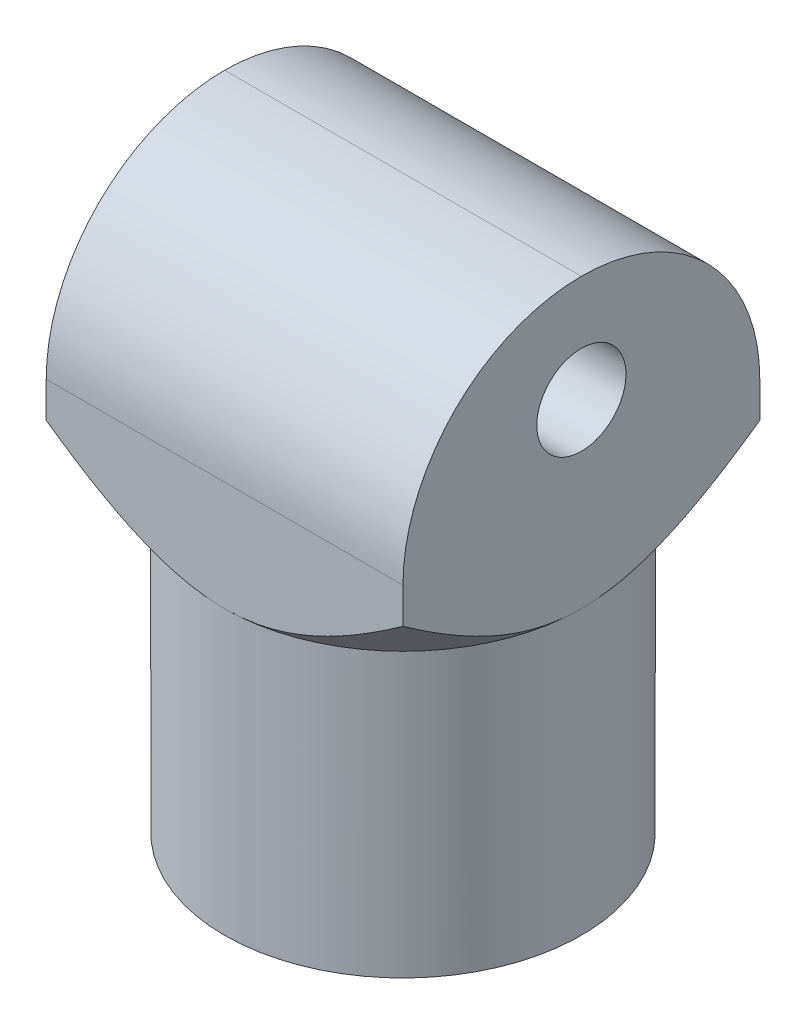
ISO-10303-21;
HEADER;
FILE_DESCRIPTION(('STEP AP214'),'2;1');
FILE_NAME('part.step','',(''),(''),'','','');
FILE_SCHEMA(('AUTOMOTIVE_DESIGN { 1 0 10303 214 1 1 1 1 }'));
ENDSEC;
DATA;
#1=APPLICATION_CONTEXT('core data for automotive mechanical design processes');
#2=APPLICATION_PROTOCOL_DEFINITION('international standard','automotive_design',2000,#1);
#3=PRODUCT_CONTEXT('',#1,'mechanical');
#4=PRODUCT('Part','Part','',(#3));
#5=PRODUCT_RELATED_PRODUCT_CATEGORY('part','',(#4));
#6=PRODUCT_DEFINITION_FORMATION('','',#4);
#7=PRODUCT_DEFINITION_CONTEXT('part definition',#1,'design');
#8=PRODUCT_DEFINITION('design','',#6,#7);
#9=PRODUCT_DEFINITION_SHAPE('','',#8);
#10=(LENGTH_UNIT() NAMED_UNIT(*) SI_UNIT(.MILLI.,.METRE.));
#11=(NAMED_UNIT(*) PLANE_ANGLE_UNIT() SI_UNIT($,.RADIAN.));
#12=(NAMED_UNIT(*) SI_UNIT($,.STERADIAN.) SOLID_ANGLE_UNIT());
#13=UNCERTAINTY_MEASURE_WITH_UNIT(LENGTH_MEASURE(1.E-05),#10,'distance_accuracy_value','');
#14=(GEOMETRIC_REPRESENTATION_CONTEXT(3) GLOBAL_UNCERTAINTY_ASSIGNED_CONTEXT((#13)) GLOBAL_UNIT_ASSIGNED_CONTEXT((#10,
#11,#12)) REPRESENTATION_CONTEXT('',''));
#15=CARTESIAN_POINT('',(0.,0.,0.));
#16=DIRECTION('',(0.,0.,1.));
#17=DIRECTION('',(1.,0.,0.));
#18=AXIS2_PLACEMENT_3D('',#15,#16,#17);
#19=CARTESIAN_POINT('',(0.,0.,0.));
#20=DIRECTION('',(0.,-1.,0.));
#21=DIRECTION('',(0.,0.,-1.));
#22=AXIS2_PLACEMENT_3D('',#19,#20,#21);
#23=PLANE('',#22);
#24=DIRECTION('',(0.,0.,-1.));
#25=VECTOR('',#24,1.);
#26=CARTESIAN_POINT('',(10.,0.,0.));
#27=LINE('',#26,#25);
#28=CARTESIAN_POINT('',(10.,0.,-9.9984897719211));
#29=VERTEX_POINT('',#28);
#30=CARTESIAN_POINT('',(10.,0.,-10.));
#31=VERTEX_POINT('',#30);
#32=EDGE_CURVE('E263',#29,#31,#27,.T.);
#33=ORIENTED_EDGE('',*,*,#32,.F.);
#34=CARTESIAN_POINT('',(5.,0.,-5.));
#35=DIRECTION('',(0.,-1.,0.));
#36=DIRECTION('',(0.,0.,-1.));
#37=AXIS2_PLACEMENT_3D('',#34,#35,#36);
#38=CIRCLE('',#37,7.06999999999999);
#39=CARTESIAN_POINT('',(9.9984897719211,0.,-10.));
#40=VERTEX_POINT('',#39);
#41=EDGE_CURVE('E331',#29,#40,#38,.F.);
#42=ORIENTED_EDGE('',*,*,#41,.T.);
#43=DIRECTION('',(-1.,0.,0.));
#44=VECTOR('',#43,1.);
#45=CARTESIAN_POINT('',(0.,0.,-10.));
#46=LINE('',#45,#44);
#47=EDGE_CURVE('E269',#31,#40,#46,.T.);
#48=ORIENTED_EDGE('',*,*,#47,.F.);
#49=EDGE_LOOP('',(#33,#42,#48));
#50=FACE_BOUND('',#49,.T.);
#51=ADVANCED_FACE('F39',(#50),#23,.T.);
#52=DIRECTION('',(1.,0.,0.));
#53=VECTOR('',#52,1.);
#54=CARTESIAN_POINT('',(0.,0.,0.));
#55=LINE('',#54,#53);
#56=CARTESIAN_POINT('',(9.9984897719211,0.,0.));
#57=VERTEX_POINT('',#56);
#58=CARTESIAN_POINT('',(10.,0.,0.));
#59=VERTEX_POINT('',#58);
#60=EDGE_CURVE('E258',#57,#59,#55,.T.);
#61=ORIENTED_EDGE('',*,*,#60,.F.);
#62=CARTESIAN_POINT('',(5.,0.,-5.));
#63=DIRECTION('',(0.,-1.,0.));
#64=DIRECTION('',(0.,0.,-1.));
#65=AXIS2_PLACEMENT_3D('',#62,#63,#64);
#66=CIRCLE('',#65,7.06999999999999);
#67=CARTESIAN_POINT('',(10.,0.,-0.00151022807889948));
#68=VERTEX_POINT('',#67);
#69=EDGE_CURVE('E324',#57,#68,#66,.F.);
#70=ORIENTED_EDGE('',*,*,#69,.T.);
#71=EDGE_CURVE('E264',#59,#68,#27,.T.);
#72=ORIENTED_EDGE('',*,*,#71,.F.);
#73=EDGE_LOOP('',(#61,#70,#72));
#74=FACE_BOUND('',#73,.T.);
#75=ADVANCED_FACE('F429',(#74),#23,.T.);
#76=DIRECTION('',(0.,0.,1.));
#77=VECTOR('',#76,1.);
#78=CARTESIAN_POINT('',(0.,0.,0.));
#79=LINE('',#78,#77);
#80=CARTESIAN_POINT('',(0.,0.,-0.00151022807889842));
#81=VERTEX_POINT('',#80);
#82=CARTESIAN_POINT('',(0.,0.,0.));
#83=VERTEX_POINT('',#82);
#84=EDGE_CURVE('E250',#81,#83,#79,.T.);
#85=ORIENTED_EDGE('',*,*,#84,.F.);
#86=CARTESIAN_POINT('',(5.,0.,-5.));
#87=DIRECTION('',(0.,-1.,0.));
#88=DIRECTION('',(0.,0.,-1.));
#89=AXIS2_PLACEMENT_3D('',#86,#87,#88);
#90=CIRCLE('',#89,7.06999999999999);
#91=CARTESIAN_POINT('',(0.00151022807889958,0.,0.));
#92=VERTEX_POINT('',#91);
#93=EDGE_CURVE('E328',#81,#92,#90,.F.);
#94=ORIENTED_EDGE('',*,*,#93,.T.);
#95=EDGE_CURVE('E259',#83,#92,#55,.T.);
#96=ORIENTED_EDGE('',*,*,#95,.F.);
#97=EDGE_LOOP('',(#85,#94,#96));
#98=FACE_BOUND('',#97,.T.);
#99=ADVANCED_FACE('F441',(#98),#23,.T.);
#100=CARTESIAN_POINT('',(0.,6.,0.));
#101=DIRECTION('',(1.,0.,0.));
#102=DIRECTION('',(0.,0.,-1.));
#103=AXIS2_PLACEMENT_3D('',#100,#101,#102);
#104=PLANE('',#103);
#105=CARTESIAN_POINT('',(0.,3.,-5.));
#106=DIRECTION('',(1.,0.,0.));
#107=DIRECTION('',(0.,0.,-1.));
#108=AXIS2_PLACEMENT_3D('',#105,#106,#107);
#109=CIRCLE('',#108,1.25);
#110=CARTESIAN_POINT('',(0.,3.,-6.25));
#111=VERTEX_POINT('',#110);
#112=EDGE_CURVE('E246',#111,#111,#109,.T.);
#113=ORIENTED_EDGE('',*,*,#112,.T.);
#114=EDGE_LOOP('',(#113));
#115=FACE_BOUND('',#114,.T.);
#116=CARTESIAN_POINT('',(0.,1.,-5.));
#117=DIRECTION('',(1.,0.,0.));
#118=DIRECTION('',(0.,0.,-1.));
#119=AXIS2_PLACEMENT_3D('',#116,#117,#118);
#120=CIRCLE('',#119,5.);
#121=CARTESIAN_POINT('',(0.,1.,0.));
#122=VERTEX_POINT('',#121);
#123=CARTESIAN_POINT('',(0.,6.,-5.));
#124=VERTEX_POINT('',#123);
#125=EDGE_CURVE('E288',#122,#124,#120,.F.);
#126=ORIENTED_EDGE('',*,*,#125,.T.);
#127=CARTESIAN_POINT('',(0.,1.,-5.));
#128=DIRECTION('',(1.,0.,0.));
#129=DIRECTION('',(0.,0.,-1.));
#130=AXIS2_PLACEMENT_3D('',#127,#128,#129);
#131=CIRCLE('',#130,5.);
#132=CARTESIAN_POINT('',(0.,1.,-10.));
#133=VERTEX_POINT('',#132);
#134=EDGE_CURVE('E291',#124,#133,#131,.F.);
#135=ORIENTED_EDGE('',*,*,#134,.T.);
#136=DIRECTION('',(0.,-1.,0.));
#137=VECTOR('',#136,1.);
#138=CARTESIAN_POINT('',(0.,6.,-10.));
#139=LINE('',#138,#137);
#140=CARTESIAN_POINT('',(0.,0.,-10.));
#141=VERTEX_POINT('',#140);
#142=EDGE_CURVE('E272',#133,#141,#139,.T.);
#143=ORIENTED_EDGE('',*,*,#142,.T.);
#144=CARTESIAN_POINT('',(0.,0.,-9.9984897719211));
#145=VERTEX_POINT('',#144);
#146=EDGE_CURVE('E255',#141,#145,#79,.T.);
#147=ORIENTED_EDGE('',*,*,#146,.T.);
#148=CARTESIAN_POINT('',(0.,0.,-9.9984897719211));
#149=CARTESIAN_POINT('',(0.,-0.102756698613822,-9.85309425427614));
#150=CARTESIAN_POINT('',(0.,-0.204079115607872,-9.70665832138957));
#151=CARTESIAN_POINT('',(0.,-0.40313592951205,-9.4112509153773));
#152=CARTESIAN_POINT('',(0.,-0.500868254858224,-9.26227804874581));
#153=CARTESIAN_POINT('',(0.,-0.693142758224082,-8.95956069469282));
#154=CARTESIAN_POINT('',(0.,-0.787627299717254,-8.80577940843457));
#155=CARTESIAN_POINT('',(0.,-0.970938991346809,-8.49489868974961));
#156=CARTESIAN_POINT('',(0.,-1.05976712341148,-8.33779983957767));
#157=CARTESIAN_POINT('',(0.,-1.22625401262509,-8.02748549687834));
#158=CARTESIAN_POINT('',(0.,-1.30424512519817,-7.87444937340642));
#159=CARTESIAN_POINT('',(0.,-1.45232439178116,-7.56452935080698));
#160=CARTESIAN_POINT('',(0.,-1.52241097336956,-7.40764469363422));
#161=CARTESIAN_POINT('',(0.,-1.65244229095171,-7.09062647658542));
#162=CARTESIAN_POINT('',(0.,-1.71243696695435,-6.93051358702973));
#163=CARTESIAN_POINT('',(0.,-1.82051416016735,-6.60636156662115));
#164=CARTESIAN_POINT('',(0.,-1.86860470886746,-6.44232516527645));
#165=CARTESIAN_POINT('',(0.,-1.93523631882874,-6.17297723086209));
#166=CARTESIAN_POINT('',(0.,-1.95809421411976,-6.06872617683342));
#167=CARTESIAN_POINT('',(0.,-1.9977877490829,-5.85903423202377));
#168=CARTESIAN_POINT('',(0.,-2.01462132107499,-5.75359294551289));
#169=CARTESIAN_POINT('',(0.,-2.04200882366108,-5.54037346704338));
#170=CARTESIAN_POINT('',(0.,-2.05247049983673,-5.43258332218147));
#171=CARTESIAN_POINT('',(0.,-2.06648400154385,-5.21653371459881));
#172=CARTESIAN_POINT('',(0.,-2.07003432623194,-5.10827415505601));
#173=CARTESIAN_POINT('',(0.,-2.07000000000001,-5.));
#174=B_SPLINE_CURVE_WITH_KNOTS('',3,(#148,#149,#150,#151,#152,#153,#154,#155,#156,#157,#158,
#159,#160,#161,#162,#163,#164,#165,#166,#167,#168,#169,#170,#171,#172,#173),.UNSPECIFIED.,.F.,
.F.,(4,2,2,2,2,2,2,2,2,2,2,2,4),(0.,0.534148514532431,1.06860055228239,1.6099675927406,
2.15124039656352,2.66634860230817,3.18155909671436,3.69413985610086,4.20637383852882,
4.5264031591152,4.84654221568575,5.17121252085674,5.49595332236232),.UNSPECIFIED.);
#175=CARTESIAN_POINT('',(0.,-2.07000000000001,-5.));
#176=VERTEX_POINT('',#175);
#177=EDGE_CURVE('E11',#145,#176,#174,.T.);
#178=ORIENTED_EDGE('',*,*,#177,.T.);
#179=CARTESIAN_POINT('',(0.,-2.07000000000001,-5.));
#180=CARTESIAN_POINT('',(0.,-2.07000619883486,-4.92310606943147));
#181=CARTESIAN_POINT('',(0.,-2.06822530632817,-4.84622343214038));
#182=CARTESIAN_POINT('',(0.,-2.0611476450841,-4.69263243662812));
#183=CARTESIAN_POINT('',(0.,-2.05585145443564,-4.6159240518321));
#184=CARTESIAN_POINT('',(0.,-2.03480622205049,-4.38657398673068));
#185=CARTESIAN_POINT('',(0.,-2.013900023987,-4.23438065740981));
#186=CARTESIAN_POINT('',(0.,-1.95991554964958,-3.93496070387796));
#187=CARTESIAN_POINT('',(0.,-1.92705558850698,-3.78769374197493));
#188=CARTESIAN_POINT('',(0.,-1.85058687262751,-3.49597531311927));
#189=CARTESIAN_POINT('',(0.,-1.80697502026895,-3.3515246705131));
#190=CARTESIAN_POINT('',(0.,-1.66293565073777,-2.92441570838595));
#191=CARTESIAN_POINT('',(0.,-1.54896253908638,-2.64629722034861));
#192=CARTESIAN_POINT('',(0.,-1.35908722086213,-2.23792364603919));
#193=CARTESIAN_POINT('',(0.,-1.29253114279358,-2.10307497843222));
#194=CARTESIAN_POINT('',(0.,-1.15415515607734,-1.83610120688809));
#195=CARTESIAN_POINT('',(0.,-1.08233588932663,-1.70397577333601));
#196=CARTESIAN_POINT('',(0.,-0.931471899639767,-1.43712087058268));
#197=CARTESIAN_POINT('',(0.,-0.85225486965176,-1.30248963825339));
#198=CARTESIAN_POINT('',(0.,-0.68992385638343,-1.03558496064705));
#199=CARTESIAN_POINT('',(0.,-0.606809491233823,-0.903311748173727));
#200=CARTESIAN_POINT('',(0.,-0.437911647963068,-0.641729432066824));
#201=CARTESIAN_POINT('',(0.,-0.352149507407178,-0.51240649459764));
#202=CARTESIAN_POINT('',(0.,-0.177957984889134,-0.255628701573782));
#203=CARTESIAN_POINT('',(0.,-0.0895294794680639,-0.128173252140127));
#204=CARTESIAN_POINT('',(0.,0.,-0.0015102280788978));
#205=B_SPLINE_CURVE_WITH_KNOTS('',3,(#179,#180,#181,#182,#183,#184,#185,#186,#187,#188,#189,
#190,#191,#192,#193,#194,#195,#196,#197,#198,#199,#200,#201,#202,#203,#204),.UNSPECIFIED.,.F.,
.F.,(4,2,2,2,2,2,2,2,2,2,2,2,4),(0.,0.230639600941303,0.4612412827156,0.921468133464362,
1.37368020813265,1.82602271773583,2.72553875715213,3.17662343299797,3.62765318594775,
4.09620448922505,4.5648017984917,5.03029381165293,5.49563443238351),.UNSPECIFIED.);
#206=EDGE_CURVE('E371',#176,#81,#205,.T.);
#207=ORIENTED_EDGE('',*,*,#206,.T.);
#208=ORIENTED_EDGE('',*,*,#84,.T.);
#209=DIRECTION('',(0.,-1.,0.));
#210=VECTOR('',#209,1.);
#211=CARTESIAN_POINT('',(0.,6.,0.));
#212=LINE('',#211,#210);
#213=EDGE_CURVE('E284',#122,#83,#212,.T.);
#214=ORIENTED_EDGE('',*,*,#213,.F.);
#215=EDGE_LOOP('',(#126,#135,#143,#147,#178,#207,#208,#214));
#216=FACE_BOUND('',#215,.T.);
#217=ADVANCED_FACE('F436',(#115,#216),#104,.F.);
#218=CARTESIAN_POINT('',(0.,6.,0.));
#219=DIRECTION('',(0.,0.,-1.));
#220=DIRECTION('',(-1.,0.,0.));
#221=AXIS2_PLACEMENT_3D('',#218,#219,#220);
#222=PLANE('',#221);
#223=DIRECTION('',(0.,-1.,0.));
#224=VECTOR('',#223,1.);
#225=CARTESIAN_POINT('',(10.,6.,0.));
#226=LINE('',#225,#224);
#227=CARTESIAN_POINT('',(10.,1.,0.));
#228=VERTEX_POINT('',#227);
#229=EDGE_CURVE('E280',#228,#59,#226,.T.);
#230=ORIENTED_EDGE('',*,*,#229,.F.);
#231=DIRECTION('',(1.,0.,0.));
#232=VECTOR('',#231,1.);
#233=CARTESIAN_POINT('',(0.,1.,0.));
#234=LINE('',#233,#232);
#235=EDGE_CURVE('E304',#228,#122,#234,.F.);
#236=ORIENTED_EDGE('',*,*,#235,.T.);
#237=ORIENTED_EDGE('',*,*,#213,.T.);
#238=ORIENTED_EDGE('',*,*,#95,.T.);
#239=CARTESIAN_POINT('',(0.00151022807889958,0.,0.));
#240=CARTESIAN_POINT('',(0.146905745723856,-0.102756698613823,0.));
#241=CARTESIAN_POINT('',(0.293341678610426,-0.204079115607873,0.));
#242=CARTESIAN_POINT('',(0.588749084622701,-0.403135929512052,0.));
#243=CARTESIAN_POINT('',(0.737721951254193,-0.500868254858225,0.));
#244=CARTESIAN_POINT('',(1.04043930530718,-0.693142758224084,0.));
#245=CARTESIAN_POINT('',(1.19422059156543,-0.787627299717255,0.));
#246=CARTESIAN_POINT('',(1.50510131025039,-0.97093899134681,0.));
#247=CARTESIAN_POINT('',(1.66220016042233,-1.05976712341148,0.));
#248=CARTESIAN_POINT('',(1.97251450312166,-1.22625401262509,0.));
#249=CARTESIAN_POINT('',(2.12555062659358,-1.30424512519817,0.));
#250=CARTESIAN_POINT('',(2.43547064919302,-1.45232439178116,0.));
#251=CARTESIAN_POINT('',(2.59235530636578,-1.52241097336956,0.));
#252=CARTESIAN_POINT('',(2.90937352341458,-1.65244229095171,0.));
#253=CARTESIAN_POINT('',(3.06948641297027,-1.71243696695435,0.));
#254=CARTESIAN_POINT('',(3.39363843337885,-1.82051416016735,0.));
#255=CARTESIAN_POINT('',(3.55767483472355,-1.86860470886746,0.));
#256=CARTESIAN_POINT('',(3.82702276913791,-1.93523631882874,0.));
#257=CARTESIAN_POINT('',(3.93127382316658,-1.95809421411976,0.));
#258=CARTESIAN_POINT('',(4.14096576797622,-1.99778774908291,0.));
#259=CARTESIAN_POINT('',(4.24640705448711,-2.01462132107499,0.));
#260=CARTESIAN_POINT('',(4.45962653295662,-2.04200882366108,0.));
#261=CARTESIAN_POINT('',(4.56741667781853,-2.05247049983673,0.));
#262=CARTESIAN_POINT('',(4.78346628540119,-2.06648400154386,0.));
#263=CARTESIAN_POINT('',(4.89172584494398,-2.07003432623195,0.));
#264=CARTESIAN_POINT('',(5.,-2.07000000000001,0.));
#265=B_SPLINE_CURVE_WITH_KNOTS('',3,(#239,#240,#241,#242,#243,#244,#245,#246,#247,#248,#249,
#250,#251,#252,#253,#254,#255,#256,#257,#258,#259,#260,#261,#262,#263,#264),.UNSPECIFIED.,.F.,
.F.,(4,2,2,2,2,2,2,2,2,2,2,2,4),(0.,0.534148514532431,1.06860055228239,1.6099675927406,
2.15124039656352,2.66634860230818,3.18155909671436,3.69413985610086,4.20637383852882,
4.5264031591152,4.84654221568575,5.17121252085674,5.49595332236232),.UNSPECIFIED.);
#266=CARTESIAN_POINT('',(5.,-2.07000000000001,0.));
#267=VERTEX_POINT('',#266);
#268=EDGE_CURVE('E377',#92,#267,#265,.T.);
#269=ORIENTED_EDGE('',*,*,#268,.T.);
#270=CARTESIAN_POINT('',(5.,-2.07000000000001,0.));
#271=CARTESIAN_POINT('',(5.07689393056853,-2.07000619883486,0.));
#272=CARTESIAN_POINT('',(5.15377656785962,-2.06822530632817,0.));
#273=CARTESIAN_POINT('',(5.30736756337188,-2.0611476450841,0.));
#274=CARTESIAN_POINT('',(5.38407594816791,-2.05585145443564,0.));
#275=CARTESIAN_POINT('',(5.61342601326932,-2.03480622205049,0.));
#276=CARTESIAN_POINT('',(5.76561934259019,-2.013900023987,0.));
#277=CARTESIAN_POINT('',(6.06503929612204,-1.95991554964958,0.));
#278=CARTESIAN_POINT('',(6.21230625802507,-1.92705558850698,0.));
#279=CARTESIAN_POINT('',(6.50402468688073,-1.85058687262751,0.));
#280=CARTESIAN_POINT('',(6.6484753294869,-1.80697502026895,0.));
#281=CARTESIAN_POINT('',(7.07558429161405,-1.66293565073777,0.));
#282=CARTESIAN_POINT('',(7.35370277965139,-1.54896253908638,0.));
#283=CARTESIAN_POINT('',(7.76207635396081,-1.35908722086213,0.));
#284=CARTESIAN_POINT('',(7.89692502156778,-1.29253114279358,0.));
#285=CARTESIAN_POINT('',(8.16389879311191,-1.15415515607734,0.));
#286=CARTESIAN_POINT('',(8.29602422666399,-1.08233588932663,0.));
#287=CARTESIAN_POINT('',(8.56287912941732,-0.931471899639769,0.));
#288=CARTESIAN_POINT('',(8.69751036174661,-0.852254869651762,0.));
#289=CARTESIAN_POINT('',(8.96441503935295,-0.689923856383432,0.));
#290=CARTESIAN_POINT('',(9.09668825182627,-0.606809491233825,0.));
#291=CARTESIAN_POINT('',(9.35827056793318,-0.43791164796307,0.));
#292=CARTESIAN_POINT('',(9.48759350540236,-0.352149507407181,0.));
#293=CARTESIAN_POINT('',(9.74437129842622,-0.177957984889136,0.));
#294=CARTESIAN_POINT('',(9.87182674785987,-0.0895294794680655,0.));
#295=CARTESIAN_POINT('',(9.9984897719211,0.,0.));
#296=B_SPLINE_CURVE_WITH_KNOTS('',3,(#270,#271,#272,#273,#274,#275,#276,#277,#278,#279,#280,
#281,#282,#283,#284,#285,#286,#287,#288,#289,#290,#291,#292,#293,#294,#295),.UNSPECIFIED.,.F.,
.F.,(4,2,2,2,2,2,2,2,2,2,2,2,4),(0.,0.230639600941303,0.4612412827156,0.921468133464363,
1.37368020813266,1.82602271773583,2.72553875715213,3.17662343299797,3.62765318594775,
4.09620448922504,4.5648017984917,5.03029381165292,5.49563443238351),.UNSPECIFIED.);
#297=EDGE_CURVE('E337',#267,#57,#296,.T.);
#298=ORIENTED_EDGE('',*,*,#297,.T.);
#299=ORIENTED_EDGE('',*,*,#60,.T.);
#300=EDGE_LOOP('',(#230,#236,#237,#238,#269,#298,#299));
#301=FACE_BOUND('',#300,.T.);
#302=ADVANCED_FACE('F353',(#301),#222,.F.);
#303=CARTESIAN_POINT('',(10.,6.,0.));
#304=DIRECTION('',(-1.,0.,0.));
#305=DIRECTION('',(0.,0.,1.));
#306=AXIS2_PLACEMENT_3D('',#303,#304,#305);
#307=PLANE('',#306);
#308=CARTESIAN_POINT('',(10.,3.,-5.));
#309=DIRECTION('',(1.,0.,0.));
#310=DIRECTION('',(0.,0.,-1.));
#311=AXIS2_PLACEMENT_3D('',#308,#309,#310);
#312=CIRCLE('',#311,1.25);
#313=CARTESIAN_POINT('',(10.,3.,-6.25));
#314=VERTEX_POINT('',#313);
#315=EDGE_CURVE('E251',#314,#314,#312,.T.);
#316=ORIENTED_EDGE('',*,*,#315,.F.);
#317=EDGE_LOOP('',(#316));
#318=FACE_BOUND('',#317,.T.);
#319=DIRECTION('',(0.,-1.,0.));
#320=VECTOR('',#319,1.);
#321=CARTESIAN_POINT('',(10.,6.,-10.));
#322=LINE('',#321,#320);
#323=CARTESIAN_POINT('',(10.,1.,-10.));
#324=VERTEX_POINT('',#323);
#325=EDGE_CURVE('E276',#324,#31,#322,.T.);
#326=ORIENTED_EDGE('',*,*,#325,.F.);
#327=CARTESIAN_POINT('',(10.,1.,-5.));
#328=DIRECTION('',(-1.,0.,0.));
#329=DIRECTION('',(0.,0.,1.));
#330=AXIS2_PLACEMENT_3D('',#327,#328,#329);
#331=CIRCLE('',#330,5.);
#332=CARTESIAN_POINT('',(10.,6.,-5.));
#333=VERTEX_POINT('',#332);
#334=EDGE_CURVE('E301',#324,#333,#331,.F.);
#335=ORIENTED_EDGE('',*,*,#334,.T.);
#336=CARTESIAN_POINT('',(10.,1.,-5.));
#337=DIRECTION('',(-1.,0.,0.));
#338=DIRECTION('',(0.,0.,1.));
#339=AXIS2_PLACEMENT_3D('',#336,#337,#338);
#340=CIRCLE('',#339,5.);
#341=EDGE_CURVE('E298',#333,#228,#340,.F.);
#342=ORIENTED_EDGE('',*,*,#341,.T.);
#343=ORIENTED_EDGE('',*,*,#229,.T.);
#344=ORIENTED_EDGE('',*,*,#71,.T.);
#345=CARTESIAN_POINT('',(10.,0.,-0.00151022807889948));
#346=CARTESIAN_POINT('',(10.,-0.102756698613823,-0.146905745723856));
#347=CARTESIAN_POINT('',(10.,-0.204079115607873,-0.293341678610426));
#348=CARTESIAN_POINT('',(10.,-0.403135929512051,-0.588749084622702));
#349=CARTESIAN_POINT('',(10.,-0.500868254858224,-0.737721951254194));
#350=CARTESIAN_POINT('',(10.,-0.693142758224083,-1.04043930530718));
#351=CARTESIAN_POINT('',(10.,-0.787627299717256,-1.19422059156543));
#352=CARTESIAN_POINT('',(10.,-0.97093899134681,-1.50510131025039));
#353=CARTESIAN_POINT('',(10.,-1.05976712341148,-1.66220016042233));
#354=CARTESIAN_POINT('',(10.,-1.22625401262509,-1.97251450312166));
#355=CARTESIAN_POINT('',(10.,-1.30424512519817,-2.12555062659358));
#356=CARTESIAN_POINT('',(10.,-1.45232439178116,-2.43547064919302));
#357=CARTESIAN_POINT('',(10.,-1.52241097336956,-2.59235530636578));
#358=CARTESIAN_POINT('',(10.,-1.65244229095171,-2.90937352341458));
#359=CARTESIAN_POINT('',(10.,-1.71243696695435,-3.06948641297027));
#360=CARTESIAN_POINT('',(10.,-1.82051416016735,-3.39363843337885));
#361=CARTESIAN_POINT('',(10.,-1.86860470886746,-3.55767483472355));
#362=CARTESIAN_POINT('',(10.,-1.93523631882874,-3.82702276913791));
#363=CARTESIAN_POINT('',(10.,-1.95809421411976,-3.93127382316658));
#364=CARTESIAN_POINT('',(10.,-1.9977877490829,-4.14096576797622));
#365=CARTESIAN_POINT('',(10.,-2.01462132107499,-4.24640705448711));
#366=CARTESIAN_POINT('',(10.,-2.04200882366108,-4.45962653295662));
#367=CARTESIAN_POINT('',(10.,-2.05247049983673,-4.56741667781853));
#368=CARTESIAN_POINT('',(10.,-2.06648400154385,-4.78346628540119));
#369=CARTESIAN_POINT('',(10.,-2.07003432623194,-4.89172584494398));
#370=CARTESIAN_POINT('',(10.,-2.07000000000001,-5.));
#371=B_SPLINE_CURVE_WITH_KNOTS('',3,(#345,#346,#347,#348,#349,#350,#351,#352,#353,#354,#355,
#356,#357,#358,#359,#360,#361,#362,#363,#364,#365,#366,#367,#368,#369,#370),.UNSPECIFIED.,.F.,
.F.,(4,2,2,2,2,2,2,2,2,2,2,2,4),(0.,0.534148514532432,1.06860055228239,1.6099675927406,
2.15124039656352,2.66634860230818,3.18155909671436,3.69413985610086,4.20637383852882,
4.5264031591152,4.84654221568575,5.17121252085674,5.49595332236232),.UNSPECIFIED.);
#372=CARTESIAN_POINT('',(10.,-2.07000000000001,-5.));
#373=VERTEX_POINT('',#372);
#374=EDGE_CURVE('E346',#68,#373,#371,.T.);
#375=ORIENTED_EDGE('',*,*,#374,.T.);
#376=CARTESIAN_POINT('',(10.,-2.07000000000001,-5.));
#377=CARTESIAN_POINT('',(10.,-2.07000619883486,-5.07689393056853));
#378=CARTESIAN_POINT('',(10.,-2.06822530632817,-5.15377656785962));
#379=CARTESIAN_POINT('',(10.,-2.0611476450841,-5.30736756337188));
#380=CARTESIAN_POINT('',(10.,-2.05585145443564,-5.38407594816791));
#381=CARTESIAN_POINT('',(10.,-2.03480622205049,-5.61342601326932));
#382=CARTESIAN_POINT('',(10.,-2.013900023987,-5.76561934259019));
#383=CARTESIAN_POINT('',(10.,-1.95991554964958,-6.06503929612204));
#384=CARTESIAN_POINT('',(10.,-1.92705558850698,-6.21230625802507));
#385=CARTESIAN_POINT('',(10.,-1.85058687262751,-6.50402468688073));
#386=CARTESIAN_POINT('',(10.,-1.80697502026895,-6.6484753294869));
#387=CARTESIAN_POINT('',(10.,-1.66293565073777,-7.07558429161405));
#388=CARTESIAN_POINT('',(10.,-1.54896253908638,-7.35370277965139));
#389=CARTESIAN_POINT('',(10.,-1.35908722086212,-7.76207635396081));
#390=CARTESIAN_POINT('',(10.,-1.29253114279358,-7.89692502156778));
#391=CARTESIAN_POINT('',(10.,-1.15415515607734,-8.16389879311191));
#392=CARTESIAN_POINT('',(10.,-1.08233588932663,-8.29602422666399));
#393=CARTESIAN_POINT('',(10.,-0.931471899639768,-8.56287912941732));
#394=CARTESIAN_POINT('',(10.,-0.852254869651761,-8.69751036174661));
#395=CARTESIAN_POINT('',(10.,-0.689923856383431,-8.96441503935294));
#396=CARTESIAN_POINT('',(10.,-0.606809491233825,-9.09668825182627));
#397=CARTESIAN_POINT('',(10.,-0.43791164796307,-9.35827056793318));
#398=CARTESIAN_POINT('',(10.,-0.35214950740718,-9.48759350540236));
#399=CARTESIAN_POINT('',(10.,-0.177957984889135,-9.74437129842621));
#400=CARTESIAN_POINT('',(10.,-0.089529479468064,-9.87182674785987));
#401=CARTESIAN_POINT('',(10.,0.,-9.9984897719211));
#402=B_SPLINE_CURVE_WITH_KNOTS('',3,(#376,#377,#378,#379,#380,#381,#382,#383,#384,#385,#386,
#387,#388,#389,#390,#391,#392,#393,#394,#395,#396,#397,#398,#399,#400,#401),.UNSPECIFIED.,.F.,
.F.,(4,2,2,2,2,2,2,2,2,2,2,2,4),(0.,0.230639600941304,0.461241282715601,0.921468133464364,
1.37368020813266,1.82602271773583,2.72553875715213,3.17662343299797,3.62765318594775,
4.09620448922504,4.5648017984917,5.03029381165292,5.49563443238351),.UNSPECIFIED.);
#403=EDGE_CURVE('E384',#373,#29,#402,.T.);
#404=ORIENTED_EDGE('',*,*,#403,.T.);
#405=ORIENTED_EDGE('',*,*,#32,.T.);
#406=EDGE_LOOP('',(#326,#335,#342,#343,#344,#375,#404,#405));
#407=FACE_BOUND('',#406,.T.);
#408=ADVANCED_FACE('F396',(#318,#407),#307,.F.);
#409=CARTESIAN_POINT('',(0.,6.,-10.));
#410=DIRECTION('',(0.,0.,1.));
#411=DIRECTION('',(1.,0.,0.));
#412=AXIS2_PLACEMENT_3D('',#409,#410,#411);
#413=PLANE('',#412);
#414=ORIENTED_EDGE('',*,*,#142,.F.);
#415=DIRECTION('',(-1.,0.,0.));
#416=VECTOR('',#415,1.);
#417=CARTESIAN_POINT('',(0.,1.,-10.));
#418=LINE('',#417,#416);
#419=EDGE_CURVE('E294',#133,#324,#418,.F.);
#420=ORIENTED_EDGE('',*,*,#419,.T.);
#421=ORIENTED_EDGE('',*,*,#325,.T.);
#422=ORIENTED_EDGE('',*,*,#47,.T.);
#423=CARTESIAN_POINT('',(9.9984897719211,0.,-10.));
#424=CARTESIAN_POINT('',(9.85309425427614,-0.102756698613823,-10.));
#425=CARTESIAN_POINT('',(9.70665832138957,-0.204079115607872,-10.));
#426=CARTESIAN_POINT('',(9.4112509153773,-0.40313592951205,-10.));
#427=CARTESIAN_POINT('',(9.2622780487458,-0.500868254858224,-10.));
#428=CARTESIAN_POINT('',(8.95956069469282,-0.693142758224083,-10.));
#429=CARTESIAN_POINT('',(8.80577940843457,-0.787627299717255,-10.));
#430=CARTESIAN_POINT('',(8.49489868974961,-0.97093899134681,-10.));
#431=CARTESIAN_POINT('',(8.33779983957767,-1.05976712341148,-10.));
#432=CARTESIAN_POINT('',(8.02748549687834,-1.22625401262509,-10.));
#433=CARTESIAN_POINT('',(7.87444937340642,-1.30424512519817,-10.));
#434=CARTESIAN_POINT('',(7.56452935080698,-1.45232439178116,-10.));
#435=CARTESIAN_POINT('',(7.40764469363422,-1.52241097336956,-10.));
#436=CARTESIAN_POINT('',(7.09062647658542,-1.65244229095171,-10.));
#437=CARTESIAN_POINT('',(6.93051358702973,-1.71243696695435,-10.));
#438=CARTESIAN_POINT('',(6.60636156662115,-1.82051416016735,-10.));
#439=CARTESIAN_POINT('',(6.44232516527644,-1.86860470886745,-10.));
#440=CARTESIAN_POINT('',(6.17297723086209,-1.93523631882874,-10.));
#441=CARTESIAN_POINT('',(6.06872617683342,-1.95809421411976,-10.));
#442=CARTESIAN_POINT('',(5.85903423202377,-1.9977877490829,-10.));
#443=CARTESIAN_POINT('',(5.75359294551289,-2.01462132107499,-10.));
#444=CARTESIAN_POINT('',(5.54037346704338,-2.04200882366108,-10.));
#445=CARTESIAN_POINT('',(5.43258332218147,-2.05247049983673,-10.));
#446=CARTESIAN_POINT('',(5.21653371459881,-2.06648400154385,-10.));
#447=CARTESIAN_POINT('',(5.10827415505602,-2.07003432623194,-10.));
#448=CARTESIAN_POINT('',(5.,-2.07000000000001,-10.));
#449=B_SPLINE_CURVE_WITH_KNOTS('',3,(#423,#424,#425,#426,#427,#428,#429,#430,#431,#432,#433,
#434,#435,#436,#437,#438,#439,#440,#441,#442,#443,#444,#445,#446,#447,#448),.UNSPECIFIED.,.F.,
.F.,(4,2,2,2,2,2,2,2,2,2,2,2,4),(0.,0.534148514532431,1.06860055228239,1.6099675927406,
2.15124039656352,2.66634860230818,3.18155909671436,3.69413985610086,4.20637383852882,
4.5264031591152,4.84654221568575,5.17121252085674,5.49595332236232),.UNSPECIFIED.);
#450=CARTESIAN_POINT('',(5.,-2.07000000000001,-10.));
#451=VERTEX_POINT('',#450);
#452=EDGE_CURVE('E61',#40,#451,#449,.T.);
#453=ORIENTED_EDGE('',*,*,#452,.T.);
#454=CARTESIAN_POINT('',(5.,-2.07000000000001,-10.));
#455=CARTESIAN_POINT('',(4.92310606943147,-2.07000619883486,-10.));
#456=CARTESIAN_POINT('',(4.84622343214038,-2.06822530632817,-10.));
#457=CARTESIAN_POINT('',(4.69263243662812,-2.0611476450841,-10.));
#458=CARTESIAN_POINT('',(4.6159240518321,-2.05585145443564,-10.));
#459=CARTESIAN_POINT('',(4.38657398673068,-2.03480622205049,-10.));
#460=CARTESIAN_POINT('',(4.23438065740981,-2.013900023987,-10.));
#461=CARTESIAN_POINT('',(3.93496070387796,-1.95991554964958,-10.));
#462=CARTESIAN_POINT('',(3.78769374197493,-1.92705558850698,-10.));
#463=CARTESIAN_POINT('',(3.49597531311927,-1.85058687262751,-10.));
#464=CARTESIAN_POINT('',(3.3515246705131,-1.80697502026895,-10.));
#465=CARTESIAN_POINT('',(2.92441570838595,-1.66293565073777,-10.));
#466=CARTESIAN_POINT('',(2.64629722034861,-1.54896253908638,-10.));
#467=CARTESIAN_POINT('',(2.23792364603919,-1.35908722086212,-10.));
#468=CARTESIAN_POINT('',(2.10307497843222,-1.29253114279358,-10.));
#469=CARTESIAN_POINT('',(1.83610120688809,-1.15415515607734,-10.));
#470=CARTESIAN_POINT('',(1.70397577333601,-1.08233588932663,-10.));
#471=CARTESIAN_POINT('',(1.43712087058268,-0.931471899639767,-10.));
#472=CARTESIAN_POINT('',(1.30248963825339,-0.85225486965176,-10.));
#473=CARTESIAN_POINT('',(1.03558496064705,-0.689923856383431,-10.));
#474=CARTESIAN_POINT('',(0.90331174817373,-0.606809491233824,-10.));
#475=CARTESIAN_POINT('',(0.641729432066827,-0.437911647963069,-10.));
#476=CARTESIAN_POINT('',(0.512406494597643,-0.352149507407179,-10.));
#477=CARTESIAN_POINT('',(0.255628701573785,-0.177957984889135,-10.));
#478=CARTESIAN_POINT('',(0.128173252140131,-0.0895294794680649,-10.));
#479=CARTESIAN_POINT('',(0.0015102280789013,0.,-10.));
#480=B_SPLINE_CURVE_WITH_KNOTS('',3,(#454,#455,#456,#457,#458,#459,#460,#461,#462,#463,#464,
#465,#466,#467,#468,#469,#470,#471,#472,#473,#474,#475,#476,#477,#478,#479),.UNSPECIFIED.,.F.,
.F.,(4,2,2,2,2,2,2,2,2,2,2,2,4),(0.,0.230639600941302,0.4612412827156,0.921468133464363,
1.37368020813266,1.82602271773583,2.72553875715213,3.17662343299797,3.62765318594775,
4.09620448922504,4.5648017984917,5.03029381165292,5.49563443238351),.UNSPECIFIED.);
#481=CARTESIAN_POINT('',(0.00151022807890109,0.,-10.));
#482=VERTEX_POINT('',#481);
#483=EDGE_CURVE('E54',#451,#482,#480,.T.);
#484=ORIENTED_EDGE('',*,*,#483,.T.);
#485=EDGE_CURVE('E268',#482,#141,#46,.T.);
#486=ORIENTED_EDGE('',*,*,#485,.T.);
#487=EDGE_LOOP('',(#414,#420,#421,#422,#453,#484,#486));
#488=FACE_BOUND('',#487,.T.);
#489=ADVANCED_FACE('F399',(#488),#413,.F.);
#490=ORIENTED_EDGE('',*,*,#485,.F.);
#491=CARTESIAN_POINT('',(5.,0.,-5.));
#492=DIRECTION('',(0.,-1.,0.));
#493=DIRECTION('',(0.,0.,-1.));
#494=AXIS2_PLACEMENT_3D('',#491,#492,#493);
#495=CIRCLE('',#494,7.06999999999999);
#496=EDGE_CURVE('E334',#482,#145,#495,.F.);
#497=ORIENTED_EDGE('',*,*,#496,.T.);
#498=ORIENTED_EDGE('',*,*,#146,.F.);
#499=EDGE_LOOP('',(#490,#497,#498));
#500=FACE_BOUND('',#499,.T.);
#501=ADVANCED_FACE('F405',(#500),#23,.T.);
#502=CARTESIAN_POINT('',(0.,3.,-5.));
#503=DIRECTION('',(1.,0.,0.));
#504=DIRECTION('',(0.,0.,-1.));
#505=AXIS2_PLACEMENT_3D('',#502,#503,#504);
#506=CYLINDRICAL_SURFACE('',#505,1.25);
#507=ORIENTED_EDGE('',*,*,#112,.F.);
#508=EDGE_LOOP('',(#507));
#509=FACE_BOUND('',#508,.T.);
#510=ORIENTED_EDGE('',*,*,#315,.T.);
#511=EDGE_LOOP('',(#510));
#512=FACE_BOUND('',#511,.T.);
#513=ADVANCED_FACE('F472',(#509,#512),#506,.F.);
#514=CARTESIAN_POINT('',(0.,1.,-5.));
#515=DIRECTION('',(1.,0.,0.));
#516=DIRECTION('',(0.,0.,-1.));
#517=AXIS2_PLACEMENT_3D('',#514,#515,#516);
#518=CYLINDRICAL_SURFACE('',#517,5.);
#519=ORIENTED_EDGE('',*,*,#235,.F.);
#520=ORIENTED_EDGE('',*,*,#341,.F.);
#521=DIRECTION('',(1.,0.,0.));
#522=VECTOR('',#521,1.);
#523=CARTESIAN_POINT('',(0.,6.,-5.));
#524=LINE('',#523,#522);
#525=EDGE_CURVE('E245',#124,#333,#524,.T.);
#526=ORIENTED_EDGE('',*,*,#525,.F.);
#527=ORIENTED_EDGE('',*,*,#125,.F.);
#528=EDGE_LOOP('',(#519,#520,#526,#527));
#529=FACE_BOUND('',#528,.T.);
#530=ADVANCED_FACE('F362',(#529),#518,.T.);
#531=CARTESIAN_POINT('',(0.,1.,-5.));
#532=DIRECTION('',(-1.,0.,0.));
#533=DIRECTION('',(0.,0.,1.));
#534=AXIS2_PLACEMENT_3D('',#531,#532,#533);
#535=CYLINDRICAL_SURFACE('',#534,5.);
#536=ORIENTED_EDGE('',*,*,#334,.F.);
#537=ORIENTED_EDGE('',*,*,#419,.F.);
#538=ORIENTED_EDGE('',*,*,#134,.F.);
#539=ORIENTED_EDGE('',*,*,#525,.T.);
#540=EDGE_LOOP('',(#536,#537,#538,#539));
#541=FACE_BOUND('',#540,.T.);
#542=ADVANCED_FACE('F450',(#541),#535,.T.);
#543=CARTESIAN_POINT('',(5.,-10.,-5.));
#544=DIRECTION('',(0.,-1.,0.));
#545=DIRECTION('',(0.,0.,-1.));
#546=AXIS2_PLACEMENT_3D('',#543,#544,#545);
#547=PLANE('',#546);
#548=CARTESIAN_POINT('',(5.,-10.,-5.));
#549=DIRECTION('',(0.,-1.,0.));
#550=DIRECTION('',(0.,0.,-1.));
#551=AXIS2_PLACEMENT_3D('',#548,#549,#550);
#552=CIRCLE('',#551,5.);
#553=CARTESIAN_POINT('',(5.,-10.,-10.));
#554=VERTEX_POINT('',#553);
#555=EDGE_CURVE('E186',#554,#554,#552,.T.);
#556=ORIENTED_EDGE('',*,*,#555,.T.);
#557=EDGE_LOOP('',(#556));
#558=FACE_BOUND('',#557,.T.);
#559=DIRECTION('',(0.992815009250093,0.,0.119659338990895));
#560=VECTOR('',#559,1.);
#561=CARTESIAN_POINT('',(3.82078904797662,-10.,-7.7609409381516));
#562=LINE('',#561,#560);
#563=CARTESIAN_POINT('',(3.82078904797662,-10.,-7.7609409381516));
#564=VERTEX_POINT('',#563);
#565=CARTESIAN_POINT('',(6.80143951477603,-10.,-7.40169710994888));
#566=VERTEX_POINT('',#565);
#567=EDGE_CURVE('E177',#564,#566,#562,.T.);
#568=ORIENTED_EDGE('',*,*,#567,.F.);
#569=DIRECTION('',(0.600035531991215,0.,-0.799973349773616));
#570=VECTOR('',#569,1.);
#571=CARTESIAN_POINT('',(2.01934953320058,-10.,-5.35924382820272));
#572=LINE('',#571,#570);
#573=CARTESIAN_POINT('',(2.01934953320058,-10.,-5.35924382820272));
#574=VERTEX_POINT('',#573);
#575=EDGE_CURVE('E166',#574,#564,#572,.T.);
#576=ORIENTED_EDGE('',*,*,#575,.F.);
#577=DIRECTION('',(-0.392779477258878,0.,-0.91963268876451));
#578=VECTOR('',#577,1.);
#579=CARTESIAN_POINT('',(3.19856048522397,-10.,-2.59830289005112));
#580=LINE('',#579,#578);
#581=CARTESIAN_POINT('',(3.19856048522397,-10.,-2.59830289005112));
#582=VERTEX_POINT('',#581);
#583=EDGE_CURVE('E206',#582,#574,#580,.T.);
#584=ORIENTED_EDGE('',*,*,#583,.F.);
#585=DIRECTION('',(-0.992815009250093,0.,-0.119659338990895));
#586=VECTOR('',#585,1.);
#587=CARTESIAN_POINT('',(6.17921095202338,-10.,-2.2390590618484));
#588=LINE('',#587,#586);
#589=CARTESIAN_POINT('',(6.17921095202338,-10.,-2.2390590618484));
#590=VERTEX_POINT('',#589);
#591=EDGE_CURVE('E202',#590,#582,#588,.T.);
#592=ORIENTED_EDGE('',*,*,#591,.F.);
#593=DIRECTION('',(-0.600035531991215,0.,0.799973349773616));
#594=VECTOR('',#593,1.);
#595=CARTESIAN_POINT('',(7.98065046679942,-10.,-4.64075617179728));
#596=LINE('',#595,#594);
#597=CARTESIAN_POINT('',(7.98065046679942,-10.,-4.64075617179728));
#598=VERTEX_POINT('',#597);
#599=EDGE_CURVE('E197',#598,#590,#596,.T.);
#600=ORIENTED_EDGE('',*,*,#599,.F.);
#601=DIRECTION('',(0.392779477258878,0.,0.91963268876451));
#602=VECTOR('',#601,1.);
#603=CARTESIAN_POINT('',(6.80143951477603,-10.,-7.40169710994888));
#604=LINE('',#603,#602);
#605=EDGE_CURVE('E192',#566,#598,#604,.T.);
#606=ORIENTED_EDGE('',*,*,#605,.F.);
#607=EDGE_LOOP('',(#568,#576,#584,#592,#600,#606));
#608=FACE_BOUND('',#607,.T.);
#609=ADVANCED_FACE('F190',(#558,#608),#547,.T.);
#610=CARTESIAN_POINT('',(5.,-10.,-5.));
#611=DIRECTION('',(0.,1.,0.));
#612=DIRECTION('',(0.,0.,1.));
#613=AXIS2_PLACEMENT_3D('',#610,#611,#612);
#614=CYLINDRICAL_SURFACE('',#613,5.);
#615=CARTESIAN_POINT('',(5.,-2.07000000000001,-5.));
#616=DIRECTION('',(0.,-1.,0.));
#617=DIRECTION('',(0.,0.,-1.));
#618=AXIS2_PLACEMENT_3D('',#615,#616,#617);
#619=CIRCLE('',#618,5.);
#620=EDGE_CURVE('E313',#451,#373,#619,.T.);
#621=ORIENTED_EDGE('',*,*,#620,.T.);
#622=CARTESIAN_POINT('',(5.,-2.07000000000001,-5.));
#623=DIRECTION('',(0.,-1.,0.));
#624=DIRECTION('',(0.,0.,-1.));
#625=AXIS2_PLACEMENT_3D('',#622,#623,#624);
#626=CIRCLE('',#625,5.);
#627=EDGE_CURVE('E320',#373,#267,#626,.T.);
#628=ORIENTED_EDGE('',*,*,#627,.T.);
#629=CARTESIAN_POINT('',(5.,-2.07000000000001,-5.));
#630=DIRECTION('',(0.,-1.,0.));
#631=DIRECTION('',(0.,0.,-1.));
#632=AXIS2_PLACEMENT_3D('',#629,#630,#631);
#633=CIRCLE('',#632,5.);
#634=EDGE_CURVE('E317',#267,#176,#633,.T.);
#635=ORIENTED_EDGE('',*,*,#634,.T.);
#636=CARTESIAN_POINT('',(5.,-2.07000000000001,-5.));
#637=DIRECTION('',(0.,-1.,0.));
#638=DIRECTION('',(0.,0.,-1.));
#639=AXIS2_PLACEMENT_3D('',#636,#637,#638);
#640=CIRCLE('',#639,5.);
#641=EDGE_CURVE('E307',#176,#451,#640,.T.);
#642=ORIENTED_EDGE('',*,*,#641,.T.);
#643=EDGE_LOOP('',(#621,#628,#635,#642));
#644=FACE_BOUND('',#643,.T.);
#645=ORIENTED_EDGE('',*,*,#555,.F.);
#646=EDGE_LOOP('',(#645));
#647=FACE_BOUND('',#646,.T.);
#648=ADVANCED_FACE('F459',(#644,#647),#614,.T.);
#649=CARTESIAN_POINT('',(2.01934953320058,-10.,-5.35924382820272));
#650=DIRECTION('',(0.799973349773616,0.,0.600035531991215));
#651=DIRECTION('',(0.600035531991215,0.,-0.799973349773616));
#652=AXIS2_PLACEMENT_3D('',#649,#650,#651);
#653=PLANE('',#652);
#654=DIRECTION('',(0.600035531991215,0.,-0.799973349773616));
#655=VECTOR('',#654,1.);
#656=CARTESIAN_POINT('',(2.01934953320058,0.,-5.35924382820272));
#657=LINE('',#656,#655);
#658=CARTESIAN_POINT('',(2.01934953320058,0.,-5.35924382820272));
#659=VERTEX_POINT('',#658);
#660=CARTESIAN_POINT('',(3.82078904797662,0.,-7.7609409381516));
#661=VERTEX_POINT('',#660);
#662=EDGE_CURVE('E209',#659,#661,#657,.T.);
#663=ORIENTED_EDGE('',*,*,#662,.F.);
#664=DIRECTION('',(0.,1.,0.));
#665=VECTOR('',#664,1.);
#666=CARTESIAN_POINT('',(2.01934953320058,-10.,-5.35924382820272));
#667=LINE('',#666,#665);
#668=EDGE_CURVE('E172',#574,#659,#667,.T.);
#669=ORIENTED_EDGE('',*,*,#668,.F.);
#670=ORIENTED_EDGE('',*,*,#575,.T.);
#671=DIRECTION('',(0.,1.,0.));
#672=VECTOR('',#671,1.);
#673=CARTESIAN_POINT('',(3.82078904797662,-10.,-7.7609409381516));
#674=LINE('',#673,#672);
#675=EDGE_CURVE('E170',#564,#661,#674,.T.);
#676=ORIENTED_EDGE('',*,*,#675,.T.);
#677=EDGE_LOOP('',(#663,#669,#670,#676));
#678=FACE_BOUND('',#677,.T.);
#679=ADVANCED_FACE('F169',(#678),#653,.T.);
#680=CARTESIAN_POINT('',(3.82078904797662,-10.,-7.7609409381516));
#681=DIRECTION('',(-0.119659338990895,0.,0.992815009250093));
#682=DIRECTION('',(0.992815009250093,0.,0.119659338990895));
#683=AXIS2_PLACEMENT_3D('',#680,#681,#682);
#684=PLANE('',#683);
#685=DIRECTION('',(0.992815009250093,0.,0.119659338990895));
#686=VECTOR('',#685,1.);
#687=CARTESIAN_POINT('',(3.82078904797662,0.,-7.7609409381516));
#688=LINE('',#687,#686);
#689=CARTESIAN_POINT('',(6.80143951477603,0.,-7.40169710994888));
#690=VERTEX_POINT('',#689);
#691=EDGE_CURVE('E184',#661,#690,#688,.T.);
#692=ORIENTED_EDGE('',*,*,#691,.F.);
#693=ORIENTED_EDGE('',*,*,#675,.F.);
#694=ORIENTED_EDGE('',*,*,#567,.T.);
#695=DIRECTION('',(0.,1.,0.));
#696=VECTOR('',#695,1.);
#697=CARTESIAN_POINT('',(6.80143951477603,-10.,-7.40169710994888));
#698=LINE('',#697,#696);
#699=EDGE_CURVE('E187',#566,#690,#698,.T.);
#700=ORIENTED_EDGE('',*,*,#699,.T.);
#701=EDGE_LOOP('',(#692,#693,#694,#700));
#702=FACE_BOUND('',#701,.T.);
#703=ADVANCED_FACE('F181',(#702),#684,.T.);
#704=CARTESIAN_POINT('',(6.80143951477603,-10.,-7.40169710994888));
#705=DIRECTION('',(-0.91963268876451,0.,0.392779477258878));
#706=DIRECTION('',(0.392779477258878,0.,0.91963268876451));
#707=AXIS2_PLACEMENT_3D('',#704,#705,#706);
#708=PLANE('',#707);
#709=DIRECTION('',(0.392779477258878,0.,0.91963268876451));
#710=VECTOR('',#709,1.);
#711=CARTESIAN_POINT('',(6.80143951477603,0.,-7.40169710994888));
#712=LINE('',#711,#710);
#713=CARTESIAN_POINT('',(7.98065046679942,0.,-4.64075617179728));
#714=VERTEX_POINT('',#713);
#715=EDGE_CURVE('E214',#690,#714,#712,.T.);
#716=ORIENTED_EDGE('',*,*,#715,.F.);
#717=ORIENTED_EDGE('',*,*,#699,.F.);
#718=ORIENTED_EDGE('',*,*,#605,.T.);
#719=DIRECTION('',(0.,1.,0.));
#720=VECTOR('',#719,1.);
#721=CARTESIAN_POINT('',(7.98065046679942,-10.,-4.64075617179728));
#722=LINE('',#721,#720);
#723=EDGE_CURVE('E237',#598,#714,#722,.T.);
#724=ORIENTED_EDGE('',*,*,#723,.T.);
#725=EDGE_LOOP('',(#716,#717,#718,#724));
#726=FACE_BOUND('',#725,.T.);
#727=ADVANCED_FACE('F579',(#726),#708,.T.);
#728=CARTESIAN_POINT('',(7.98065046679942,-10.,-4.64075617179728));
#729=DIRECTION('',(-0.799973349773616,0.,-0.600035531991215));
#730=DIRECTION('',(-0.600035531991215,0.,0.799973349773616));
#731=AXIS2_PLACEMENT_3D('',#728,#729,#730);
#732=PLANE('',#731);
#733=DIRECTION('',(-0.600035531991215,0.,0.799973349773616));
#734=VECTOR('',#733,1.);
#735=CARTESIAN_POINT('',(7.98065046679942,0.,-4.64075617179728));
#736=LINE('',#735,#734);
#737=CARTESIAN_POINT('',(6.17921095202338,0.,-2.2390590618484));
#738=VERTEX_POINT('',#737);
#739=EDGE_CURVE('E218',#714,#738,#736,.T.);
#740=ORIENTED_EDGE('',*,*,#739,.F.);
#741=ORIENTED_EDGE('',*,*,#723,.F.);
#742=ORIENTED_EDGE('',*,*,#599,.T.);
#743=DIRECTION('',(0.,1.,0.));
#744=VECTOR('',#743,1.);
#745=CARTESIAN_POINT('',(6.17921095202338,-10.,-2.2390590618484));
#746=LINE('',#745,#744);
#747=EDGE_CURVE('E234',#590,#738,#746,.T.);
#748=ORIENTED_EDGE('',*,*,#747,.T.);
#749=EDGE_LOOP('',(#740,#741,#742,#748));
#750=FACE_BOUND('',#749,.T.);
#751=ADVANCED_FACE('F569',(#750),#732,.T.);
#752=CARTESIAN_POINT('',(6.17921095202338,-10.,-2.2390590618484));
#753=DIRECTION('',(0.119659338990895,0.,-0.992815009250093));
#754=DIRECTION('',(-0.992815009250093,0.,-0.119659338990895));
#755=AXIS2_PLACEMENT_3D('',#752,#753,#754);
#756=PLANE('',#755);
#757=DIRECTION('',(-0.992815009250093,0.,-0.119659338990895));
#758=VECTOR('',#757,1.);
#759=CARTESIAN_POINT('',(6.17921095202338,0.,-2.2390590618484));
#760=LINE('',#759,#758);
#761=CARTESIAN_POINT('',(3.19856048522397,0.,-2.59830289005112));
#762=VERTEX_POINT('',#761);
#763=EDGE_CURVE('E222',#738,#762,#760,.T.);
#764=ORIENTED_EDGE('',*,*,#763,.F.);
#765=ORIENTED_EDGE('',*,*,#747,.F.);
#766=ORIENTED_EDGE('',*,*,#591,.T.);
#767=DIRECTION('',(0.,1.,0.));
#768=VECTOR('',#767,1.);
#769=CARTESIAN_POINT('',(3.19856048522397,-10.,-2.59830289005112));
#770=LINE('',#769,#768);
#771=EDGE_CURVE('E231',#582,#762,#770,.T.);
#772=ORIENTED_EDGE('',*,*,#771,.T.);
#773=EDGE_LOOP('',(#764,#765,#766,#772));
#774=FACE_BOUND('',#773,.T.);
#775=ADVANCED_FACE('F485',(#774),#756,.T.);
#776=CARTESIAN_POINT('',(3.19856048522397,-10.,-2.59830289005112));
#777=DIRECTION('',(0.91963268876451,0.,-0.392779477258878));
#778=DIRECTION('',(-0.392779477258878,0.,-0.91963268876451));
#779=AXIS2_PLACEMENT_3D('',#776,#777,#778);
#780=PLANE('',#779);
#781=DIRECTION('',(-0.392779477258878,0.,-0.91963268876451));
#782=VECTOR('',#781,1.);
#783=CARTESIAN_POINT('',(3.19856048522397,0.,-2.59830289005112));
#784=LINE('',#783,#782);
#785=EDGE_CURVE('E178',#762,#659,#784,.T.);
#786=ORIENTED_EDGE('',*,*,#785,.F.);
#787=ORIENTED_EDGE('',*,*,#771,.F.);
#788=ORIENTED_EDGE('',*,*,#583,.T.);
#789=ORIENTED_EDGE('',*,*,#668,.T.);
#790=EDGE_LOOP('',(#786,#787,#788,#789));
#791=FACE_BOUND('',#790,.T.);
#792=ADVANCED_FACE('F479',(#791),#780,.T.);
#793=ORIENTED_EDGE('',*,*,#785,.T.);
#794=ORIENTED_EDGE('',*,*,#662,.T.);
#795=ORIENTED_EDGE('',*,*,#691,.T.);
#796=ORIENTED_EDGE('',*,*,#715,.T.);
#797=ORIENTED_EDGE('',*,*,#739,.T.);
#798=ORIENTED_EDGE('',*,*,#763,.T.);
#799=EDGE_LOOP('',(#793,#794,#795,#796,#797,#798));
#800=FACE_BOUND('',#799,.T.);
#801=ADVANCED_FACE('F473',(#800),#23,.T.);
#802=CARTESIAN_POINT('',(5.,-2.07000000000001,-5.));
#803=DIRECTION('',(0.,1.,0.));
#804=DIRECTION('',(0.,0.,1.));
#805=AXIS2_PLACEMENT_3D('',#802,#803,#804);
#806=CONICAL_SURFACE('',#805,5.,0.785398163397443);
#807=ORIENTED_EDGE('',*,*,#496,.F.);
#808=ORIENTED_EDGE('',*,*,#483,.F.);
#809=ORIENTED_EDGE('',*,*,#641,.F.);
#810=ORIENTED_EDGE('',*,*,#177,.F.);
#811=EDGE_LOOP('',(#807,#808,#809,#810));
#812=FACE_BOUND('',#811,.T.);
#813=ADVANCED_FACE('F41',(#812),#806,.T.);
#814=CARTESIAN_POINT('',(5.,-2.07000000000001,-5.));
#815=DIRECTION('',(0.,1.,0.));
#816=DIRECTION('',(0.,0.,1.));
#817=AXIS2_PLACEMENT_3D('',#814,#815,#816);
#818=CONICAL_SURFACE('',#817,5.,0.785398163397443);
#819=ORIENTED_EDGE('',*,*,#41,.F.);
#820=ORIENTED_EDGE('',*,*,#403,.F.);
#821=ORIENTED_EDGE('',*,*,#620,.F.);
#822=ORIENTED_EDGE('',*,*,#452,.F.);
#823=EDGE_LOOP('',(#819,#820,#821,#822));
#824=FACE_BOUND('',#823,.T.);
#825=ADVANCED_FACE('F367',(#824),#818,.T.);
#826=CARTESIAN_POINT('',(5.,-2.07000000000001,-5.));
#827=DIRECTION('',(0.,1.,0.));
#828=DIRECTION('',(0.,0.,1.));
#829=AXIS2_PLACEMENT_3D('',#826,#827,#828);
#830=CONICAL_SURFACE('',#829,5.,0.785398163397443);
#831=ORIENTED_EDGE('',*,*,#206,.F.);
#832=ORIENTED_EDGE('',*,*,#634,.F.);
#833=ORIENTED_EDGE('',*,*,#268,.F.);
#834=ORIENTED_EDGE('',*,*,#93,.F.);
#835=EDGE_LOOP('',(#831,#832,#833,#834));
#836=FACE_BOUND('',#835,.T.);
#837=ADVANCED_FACE('F360',(#836),#830,.T.);
#838=CARTESIAN_POINT('',(5.,-2.07000000000001,-5.));
#839=DIRECTION('',(0.,1.,0.));
#840=DIRECTION('',(0.,0.,1.));
#841=AXIS2_PLACEMENT_3D('',#838,#839,#840);
#842=CONICAL_SURFACE('',#841,5.,0.785398163397443);
#843=ORIENTED_EDGE('',*,*,#374,.F.);
#844=ORIENTED_EDGE('',*,*,#69,.F.);
#845=ORIENTED_EDGE('',*,*,#297,.F.);
#846=ORIENTED_EDGE('',*,*,#627,.F.);
#847=EDGE_LOOP('',(#843,#844,#845,#846));
#848=FACE_BOUND('',#847,.T.);
#849=ADVANCED_FACE('F355',(#848),#842,.T.);
#850=CLOSED_SHELL('',(#51,#75,#99,#217,#302,#408,#489,#501,#513,#530,#542,#609,#648,#679,#703,
#727,#751,#775,#792,#801,#813,#825,#837,#849));
#851=MANIFOLD_SOLID_BREP('B2',#850);
#852=ADVANCED_BREP_SHAPE_REPRESENTATION('',(#18,#851),#14);
#853=SHAPE_DEFINITION_REPRESENTATION(#9,#852);
ENDSEC;
END-ISO-10303-21;
